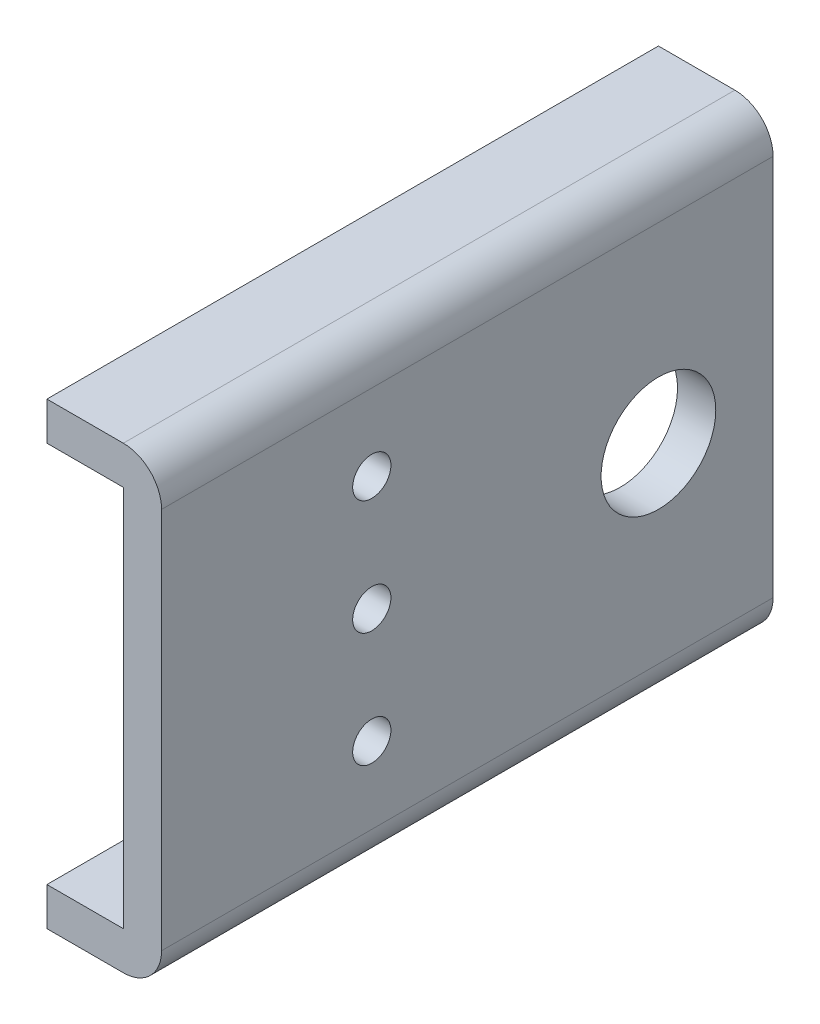
ISO-10303-21;
HEADER;
FILE_DESCRIPTION(('STEP AP214'),'2;1');
FILE_NAME('part.step','',(''),(''),'','','');
FILE_SCHEMA(('AUTOMOTIVE_DESIGN { 1 0 10303 214 1 1 1 1 }'));
ENDSEC;
DATA;
#1=APPLICATION_CONTEXT('core data for automotive mechanical design processes');
#2=APPLICATION_PROTOCOL_DEFINITION('international standard','automotive_design',2000,#1);
#3=PRODUCT_CONTEXT('',#1,'mechanical');
#4=PRODUCT('Part','Part','',(#3));
#5=PRODUCT_RELATED_PRODUCT_CATEGORY('part','',(#4));
#6=PRODUCT_DEFINITION_FORMATION('','',#4);
#7=PRODUCT_DEFINITION_CONTEXT('part definition',#1,'design');
#8=PRODUCT_DEFINITION('design','',#6,#7);
#9=PRODUCT_DEFINITION_SHAPE('','',#8);
#10=(LENGTH_UNIT() NAMED_UNIT(*) SI_UNIT(.MILLI.,.METRE.));
#11=(NAMED_UNIT(*) PLANE_ANGLE_UNIT() SI_UNIT($,.RADIAN.));
#12=(NAMED_UNIT(*) SI_UNIT($,.STERADIAN.) SOLID_ANGLE_UNIT());
#13=UNCERTAINTY_MEASURE_WITH_UNIT(LENGTH_MEASURE(1.E-05),#10,'distance_accuracy_value','');
#14=(GEOMETRIC_REPRESENTATION_CONTEXT(3) GLOBAL_UNCERTAINTY_ASSIGNED_CONTEXT((#13)) GLOBAL_UNIT_ASSIGNED_CONTEXT((#10,
#11,#12)) REPRESENTATION_CONTEXT('',''));
#15=CARTESIAN_POINT('',(0.,0.,0.));
#16=DIRECTION('',(0.,0.,1.));
#17=DIRECTION('',(1.,0.,0.));
#18=AXIS2_PLACEMENT_3D('',#15,#16,#17);
#19=CARTESIAN_POINT('',(0.,-19.05,0.));
#20=DIRECTION('',(0.,1.,0.));
#21=DIRECTION('',(-1.,0.,0.));
#22=AXIS2_PLACEMENT_3D('',#19,#20,#21);
#23=PLANE('',#22);
#24=DIRECTION('',(0.,0.,1.));
#25=VECTOR('',#24,1.);
#26=CARTESIAN_POINT('',(-9.525,-19.05,0.));
#27=LINE('',#26,#25);
#28=CARTESIAN_POINT('',(-9.525,-19.05,50.8));
#29=VERTEX_POINT('',#28);
#30=CARTESIAN_POINT('',(-9.52500000000001,-19.05,0.));
#31=VERTEX_POINT('',#30);
#32=EDGE_CURVE('E102',#29,#31,#27,.F.);
#33=ORIENTED_EDGE('',*,*,#32,.T.);
#34=DIRECTION('',(1.,0.,0.));
#35=VECTOR('',#34,1.);
#36=CARTESIAN_POINT('',(-3.17499999999999,-19.05,0.));
#37=LINE('',#36,#35);
#38=CARTESIAN_POINT('',(-3.17499999999999,-19.05,0.));
#39=VERTEX_POINT('',#38);
#40=EDGE_CURVE('E100',#31,#39,#37,.T.);
#41=ORIENTED_EDGE('',*,*,#40,.T.);
#42=DIRECTION('',(0.,0.,-1.));
#43=VECTOR('',#42,1.);
#44=CARTESIAN_POINT('',(-3.17499999999999,-19.05,0.));
#45=LINE('',#44,#43);
#46=CARTESIAN_POINT('',(-3.17499999999999,-19.05,50.8));
#47=VERTEX_POINT('',#46);
#48=EDGE_CURVE('E89',#47,#39,#45,.T.);
#49=ORIENTED_EDGE('',*,*,#48,.F.);
#50=DIRECTION('',(-1.,0.,0.));
#51=VECTOR('',#50,1.);
#52=CARTESIAN_POINT('',(-9.525,-19.05,50.8));
#53=LINE('',#52,#51);
#54=EDGE_CURVE('E96',#47,#29,#53,.T.);
#55=ORIENTED_EDGE('',*,*,#54,.T.);
#56=EDGE_LOOP('',(#33,#41,#49,#55));
#57=FACE_BOUND('',#56,.T.);
#58=ADVANCED_FACE('F16',(#57),#23,.F.);
#59=CARTESIAN_POINT('',(0.,19.05,0.));
#60=DIRECTION('',(0.,-1.,0.));
#61=DIRECTION('',(1.,0.,0.));
#62=AXIS2_PLACEMENT_3D('',#59,#60,#61);
#63=PLANE('',#62);
#64=DIRECTION('',(0.,0.,1.));
#65=VECTOR('',#64,1.);
#66=CARTESIAN_POINT('',(-9.525,19.05,50.8));
#67=LINE('',#66,#65);
#68=CARTESIAN_POINT('',(-9.525,19.05,0.));
#69=VERTEX_POINT('',#68);
#70=CARTESIAN_POINT('',(-9.52500000000001,19.05,50.8));
#71=VERTEX_POINT('',#70);
#72=EDGE_CURVE('E145',#69,#71,#67,.T.);
#73=ORIENTED_EDGE('',*,*,#72,.T.);
#74=DIRECTION('',(1.,0.,0.));
#75=VECTOR('',#74,1.);
#76=CARTESIAN_POINT('',(-3.17499999999999,19.05,50.8));
#77=LINE('',#76,#75);
#78=CARTESIAN_POINT('',(-3.17499999999999,19.05,50.8));
#79=VERTEX_POINT('',#78);
#80=EDGE_CURVE('E139',#71,#79,#77,.T.);
#81=ORIENTED_EDGE('',*,*,#80,.T.);
#82=DIRECTION('',(0.,0.,1.));
#83=VECTOR('',#82,1.);
#84=CARTESIAN_POINT('',(-3.17499999999999,19.05,50.8));
#85=LINE('',#84,#83);
#86=CARTESIAN_POINT('',(-3.17499999999999,19.05,0.));
#87=VERTEX_POINT('',#86);
#88=EDGE_CURVE('E97',#87,#79,#85,.T.);
#89=ORIENTED_EDGE('',*,*,#88,.F.);
#90=DIRECTION('',(1.,0.,0.));
#91=VECTOR('',#90,1.);
#92=CARTESIAN_POINT('',(-9.525,19.05,0.));
#93=LINE('',#92,#91);
#94=EDGE_CURVE('E115',#87,#69,#93,.F.);
#95=ORIENTED_EDGE('',*,*,#94,.T.);
#96=EDGE_LOOP('',(#73,#81,#89,#95));
#97=FACE_BOUND('',#96,.T.);
#98=ADVANCED_FACE('F255',(#97),#63,.F.);
#99=CARTESIAN_POINT('',(-3.175,15.875,50.8));
#100=DIRECTION('',(0.,0.,1.));
#101=DIRECTION('',(0.,-1.,0.));
#102=AXIS2_PLACEMENT_3D('',#99,#100,#101);
#103=CYLINDRICAL_SURFACE('',#102,3.175);
#104=CARTESIAN_POINT('',(-3.175,15.875,0.));
#105=DIRECTION('',(0.,0.,1.));
#106=DIRECTION('',(0.,-1.,0.));
#107=AXIS2_PLACEMENT_3D('',#104,#105,#106);
#108=CIRCLE('',#107,3.175);
#109=CARTESIAN_POINT('',(0.,15.875,0.));
#110=VERTEX_POINT('',#109);
#111=EDGE_CURVE('E113',#87,#110,#108,.F.);
#112=ORIENTED_EDGE('',*,*,#111,.F.);
#113=ORIENTED_EDGE('',*,*,#88,.T.);
#114=CARTESIAN_POINT('',(-3.175,15.875,50.8));
#115=DIRECTION('',(0.,0.,1.));
#116=DIRECTION('',(0.,-1.,0.));
#117=AXIS2_PLACEMENT_3D('',#114,#115,#116);
#118=CIRCLE('',#117,3.175);
#119=CARTESIAN_POINT('',(0.,15.875,50.8));
#120=VERTEX_POINT('',#119);
#121=EDGE_CURVE('E190',#79,#120,#118,.F.);
#122=ORIENTED_EDGE('',*,*,#121,.T.);
#123=DIRECTION('',(0.,0.,-1.));
#124=VECTOR('',#123,1.);
#125=CARTESIAN_POINT('',(0.,15.875,0.));
#126=LINE('',#125,#124);
#127=EDGE_CURVE('E192',#110,#120,#126,.F.);
#128=ORIENTED_EDGE('',*,*,#127,.F.);
#129=EDGE_LOOP('',(#112,#113,#122,#128));
#130=FACE_BOUND('',#129,.T.);
#131=ADVANCED_FACE('F257',(#130),#103,.T.);
#132=CARTESIAN_POINT('',(-3.175,-15.875,0.));
#133=DIRECTION('',(0.,0.,-1.));
#134=DIRECTION('',(-1.,0.,0.));
#135=AXIS2_PLACEMENT_3D('',#132,#133,#134);
#136=CYLINDRICAL_SURFACE('',#135,3.175);
#137=CARTESIAN_POINT('',(-3.175,-15.875,50.8));
#138=DIRECTION('',(0.,0.,-1.));
#139=DIRECTION('',(-1.,0.,0.));
#140=AXIS2_PLACEMENT_3D('',#137,#138,#139);
#141=CIRCLE('',#140,3.175);
#142=CARTESIAN_POINT('',(0.,-15.875,50.8));
#143=VERTEX_POINT('',#142);
#144=EDGE_CURVE('E94',#47,#143,#141,.F.);
#145=ORIENTED_EDGE('',*,*,#144,.F.);
#146=ORIENTED_EDGE('',*,*,#48,.T.);
#147=CARTESIAN_POINT('',(-3.175,-15.875,0.));
#148=DIRECTION('',(0.,0.,-1.));
#149=DIRECTION('',(-1.,0.,0.));
#150=AXIS2_PLACEMENT_3D('',#147,#148,#149);
#151=CIRCLE('',#150,3.175);
#152=CARTESIAN_POINT('',(0.,-15.875,0.));
#153=VERTEX_POINT('',#152);
#154=EDGE_CURVE('E19',#39,#153,#151,.F.);
#155=ORIENTED_EDGE('',*,*,#154,.T.);
#156=DIRECTION('',(0.,0.,-1.));
#157=VECTOR('',#156,1.);
#158=CARTESIAN_POINT('',(0.,-15.875,0.));
#159=LINE('',#158,#157);
#160=EDGE_CURVE('E196',#143,#153,#159,.T.);
#161=ORIENTED_EDGE('',*,*,#160,.F.);
#162=EDGE_LOOP('',(#145,#146,#155,#161));
#163=FACE_BOUND('',#162,.T.);
#164=ADVANCED_FACE('F91',(#163),#136,.T.);
#165=CARTESIAN_POINT('',(-9.525,-19.05,0.));
#166=DIRECTION('',(1.,0.,0.));
#167=DIRECTION('',(0.,1.,0.));
#168=AXIS2_PLACEMENT_3D('',#165,#166,#167);
#169=PLANE('',#168);
#170=DIRECTION('',(0.,1.,0.));
#171=VECTOR('',#170,1.);
#172=CARTESIAN_POINT('',(-9.525,-19.05,0.));
#173=LINE('',#172,#171);
#174=CARTESIAN_POINT('',(-9.52500000000001,-15.875,0.));
#175=VERTEX_POINT('',#174);
#176=EDGE_CURVE('E114',#31,#175,#173,.T.);
#177=ORIENTED_EDGE('',*,*,#176,.F.);
#178=ORIENTED_EDGE('',*,*,#32,.F.);
#179=DIRECTION('',(0.,1.,0.));
#180=VECTOR('',#179,1.);
#181=CARTESIAN_POINT('',(-9.525,-19.05,50.8));
#182=LINE('',#181,#180);
#183=CARTESIAN_POINT('',(-9.52500000000001,-15.875,50.8));
#184=VERTEX_POINT('',#183);
#185=EDGE_CURVE('E106',#184,#29,#182,.F.);
#186=ORIENTED_EDGE('',*,*,#185,.F.);
#187=DIRECTION('',(0.,0.,1.));
#188=VECTOR('',#187,1.);
#189=CARTESIAN_POINT('',(-9.52500000000001,-15.875,0.));
#190=LINE('',#189,#188);
#191=EDGE_CURVE('E125',#175,#184,#190,.T.);
#192=ORIENTED_EDGE('',*,*,#191,.F.);
#193=EDGE_LOOP('',(#177,#178,#186,#192));
#194=FACE_BOUND('',#193,.T.);
#195=ADVANCED_FACE('F264',(#194),#169,.F.);
#196=CARTESIAN_POINT('',(-9.525,19.05,50.8));
#197=DIRECTION('',(1.,0.,0.));
#198=DIRECTION('',(0.,1.,0.));
#199=AXIS2_PLACEMENT_3D('',#196,#197,#198);
#200=PLANE('',#199);
#201=DIRECTION('',(0.,1.,0.));
#202=VECTOR('',#201,1.);
#203=CARTESIAN_POINT('',(-9.525,19.05,50.8));
#204=LINE('',#203,#202);
#205=CARTESIAN_POINT('',(-9.52500000000001,15.875,50.8));
#206=VERTEX_POINT('',#205);
#207=EDGE_CURVE('E148',#71,#206,#204,.F.);
#208=ORIENTED_EDGE('',*,*,#207,.F.);
#209=ORIENTED_EDGE('',*,*,#72,.F.);
#210=DIRECTION('',(0.,1.,0.));
#211=VECTOR('',#210,1.);
#212=CARTESIAN_POINT('',(-9.525,19.05,0.));
#213=LINE('',#212,#211);
#214=CARTESIAN_POINT('',(-9.52500000000001,15.875,0.));
#215=VERTEX_POINT('',#214);
#216=EDGE_CURVE('E142',#215,#69,#213,.T.);
#217=ORIENTED_EDGE('',*,*,#216,.F.);
#218=DIRECTION('',(0.,0.,1.));
#219=VECTOR('',#218,1.);
#220=CARTESIAN_POINT('',(-9.52500000000001,15.875,0.));
#221=LINE('',#220,#219);
#222=EDGE_CURVE('E208',#206,#215,#221,.F.);
#223=ORIENTED_EDGE('',*,*,#222,.F.);
#224=EDGE_LOOP('',(#208,#209,#217,#223));
#225=FACE_BOUND('',#224,.T.);
#226=ADVANCED_FACE('F253',(#225),#200,.F.);
#227=CARTESIAN_POINT('',(0.,0.,0.));
#228=DIRECTION('',(1.,0.,0.));
#229=DIRECTION('',(0.,0.,-1.));
#230=AXIS2_PLACEMENT_3D('',#227,#228,#229);
#231=PLANE('',#230);
#232=DIRECTION('',(0.,1.,0.));
#233=VECTOR('',#232,1.);
#234=CARTESIAN_POINT('',(0.,15.875,0.));
#235=LINE('',#234,#233);
#236=EDGE_CURVE('E112',#110,#153,#235,.F.);
#237=ORIENTED_EDGE('',*,*,#236,.F.);
#238=ORIENTED_EDGE('',*,*,#127,.T.);
#239=DIRECTION('',(0.,1.,0.));
#240=VECTOR('',#239,1.);
#241=CARTESIAN_POINT('',(0.,15.875,50.8));
#242=LINE('',#241,#240);
#243=EDGE_CURVE('E175',#143,#120,#242,.T.);
#244=ORIENTED_EDGE('',*,*,#243,.F.);
#245=ORIENTED_EDGE('',*,*,#160,.T.);
#246=EDGE_LOOP('',(#237,#238,#244,#245));
#247=FACE_BOUND('',#246,.T.);
#248=CARTESIAN_POINT('',(0.,9.525,33.3375));
#249=DIRECTION('',(1.,0.,0.));
#250=DIRECTION('',(0.,0.,-1.));
#251=AXIS2_PLACEMENT_3D('',#248,#249,#250);
#252=CIRCLE('',#251,1.5875);
#253=CARTESIAN_POINT('',(0.,9.525,31.75));
#254=VERTEX_POINT('',#253);
#255=EDGE_CURVE('E176',#254,#254,#252,.F.);
#256=ORIENTED_EDGE('',*,*,#255,.T.);
#257=EDGE_LOOP('',(#256));
#258=FACE_BOUND('',#257,.T.);
#259=CARTESIAN_POINT('',(0.,-9.525,33.3375));
#260=DIRECTION('',(1.,0.,0.));
#261=DIRECTION('',(0.,0.,-1.));
#262=AXIS2_PLACEMENT_3D('',#259,#260,#261);
#263=CIRCLE('',#262,1.5875);
#264=CARTESIAN_POINT('',(0.,-9.525,31.75));
#265=VERTEX_POINT('',#264);
#266=EDGE_CURVE('E180',#265,#265,#263,.F.);
#267=ORIENTED_EDGE('',*,*,#266,.T.);
#268=EDGE_LOOP('',(#267));
#269=FACE_BOUND('',#268,.T.);
#270=CARTESIAN_POINT('',(0.,0.,9.525));
#271=DIRECTION('',(1.,0.,0.));
#272=DIRECTION('',(0.,0.,-1.));
#273=AXIS2_PLACEMENT_3D('',#270,#271,#272);
#274=CIRCLE('',#273,4.7625);
#275=CARTESIAN_POINT('',(0.,0.,4.7625));
#276=VERTEX_POINT('',#275);
#277=EDGE_CURVE('E183',#276,#276,#274,.F.);
#278=ORIENTED_EDGE('',*,*,#277,.T.);
#279=EDGE_LOOP('',(#278));
#280=FACE_BOUND('',#279,.T.);
#281=CARTESIAN_POINT('',(0.,0.,33.3375));
#282=DIRECTION('',(1.,0.,0.));
#283=DIRECTION('',(0.,0.,-1.));
#284=AXIS2_PLACEMENT_3D('',#281,#282,#283);
#285=CIRCLE('',#284,1.5875);
#286=CARTESIAN_POINT('',(0.,0.,31.75));
#287=VERTEX_POINT('',#286);
#288=EDGE_CURVE('E186',#287,#287,#285,.F.);
#289=ORIENTED_EDGE('',*,*,#288,.T.);
#290=EDGE_LOOP('',(#289));
#291=FACE_BOUND('',#290,.T.);
#292=ADVANCED_FACE('F258',(#247,#258,#269,#280,#291),#231,.T.);
#293=CARTESIAN_POINT('',(-9.52500000000001,0.,33.3375));
#294=DIRECTION('',(1.,0.,0.));
#295=DIRECTION('',(0.,0.,-1.));
#296=AXIS2_PLACEMENT_3D('',#293,#294,#295);
#297=CYLINDRICAL_SURFACE('',#296,1.5875);
#298=CARTESIAN_POINT('',(-3.175,0.,33.3375));
#299=DIRECTION('',(1.,0.,0.));
#300=DIRECTION('',(0.,0.,-1.));
#301=AXIS2_PLACEMENT_3D('',#298,#299,#300);
#302=CIRCLE('',#301,1.5875);
#303=CARTESIAN_POINT('',(-3.175,0.,31.75));
#304=VERTEX_POINT('',#303);
#305=EDGE_CURVE('E172',#304,#304,#302,.F.);
#306=ORIENTED_EDGE('',*,*,#305,.T.);
#307=EDGE_LOOP('',(#306));
#308=FACE_BOUND('',#307,.T.);
#309=ORIENTED_EDGE('',*,*,#288,.F.);
#310=EDGE_LOOP('',(#309));
#311=FACE_BOUND('',#310,.T.);
#312=ADVANCED_FACE('F298',(#308,#311),#297,.F.);
#313=CARTESIAN_POINT('',(-9.52500000000001,0.,9.525));
#314=DIRECTION('',(1.,0.,0.));
#315=DIRECTION('',(0.,0.,-1.));
#316=AXIS2_PLACEMENT_3D('',#313,#314,#315);
#317=CYLINDRICAL_SURFACE('',#316,4.7625);
#318=CARTESIAN_POINT('',(-3.175,0.,9.525));
#319=DIRECTION('',(1.,0.,0.));
#320=DIRECTION('',(0.,0.,-1.));
#321=AXIS2_PLACEMENT_3D('',#318,#319,#320);
#322=CIRCLE('',#321,4.7625);
#323=CARTESIAN_POINT('',(-3.175,0.,4.7625));
#324=VERTEX_POINT('',#323);
#325=EDGE_CURVE('E169',#324,#324,#322,.F.);
#326=ORIENTED_EDGE('',*,*,#325,.T.);
#327=EDGE_LOOP('',(#326));
#328=FACE_BOUND('',#327,.T.);
#329=ORIENTED_EDGE('',*,*,#277,.F.);
#330=EDGE_LOOP('',(#329));
#331=FACE_BOUND('',#330,.T.);
#332=ADVANCED_FACE('F294',(#328,#331),#317,.F.);
#333=CARTESIAN_POINT('',(-9.52500000000001,-9.525,33.3375));
#334=DIRECTION('',(1.,0.,0.));
#335=DIRECTION('',(0.,0.,-1.));
#336=AXIS2_PLACEMENT_3D('',#333,#334,#335);
#337=CYLINDRICAL_SURFACE('',#336,1.5875);
#338=CARTESIAN_POINT('',(-3.175,-9.525,33.3375));
#339=DIRECTION('',(1.,0.,0.));
#340=DIRECTION('',(0.,0.,-1.));
#341=AXIS2_PLACEMENT_3D('',#338,#339,#340);
#342=CIRCLE('',#341,1.5875);
#343=CARTESIAN_POINT('',(-3.175,-9.525,31.75));
#344=VERTEX_POINT('',#343);
#345=EDGE_CURVE('E166',#344,#344,#342,.F.);
#346=ORIENTED_EDGE('',*,*,#345,.T.);
#347=EDGE_LOOP('',(#346));
#348=FACE_BOUND('',#347,.T.);
#349=ORIENTED_EDGE('',*,*,#266,.F.);
#350=EDGE_LOOP('',(#349));
#351=FACE_BOUND('',#350,.T.);
#352=ADVANCED_FACE('F290',(#348,#351),#337,.F.);
#353=CARTESIAN_POINT('',(-9.52500000000001,9.525,33.3375));
#354=DIRECTION('',(1.,0.,0.));
#355=DIRECTION('',(0.,0.,-1.));
#356=AXIS2_PLACEMENT_3D('',#353,#354,#355);
#357=CYLINDRICAL_SURFACE('',#356,1.5875);
#358=CARTESIAN_POINT('',(-3.175,9.525,33.3375));
#359=DIRECTION('',(1.,0.,0.));
#360=DIRECTION('',(0.,0.,-1.));
#361=AXIS2_PLACEMENT_3D('',#358,#359,#360);
#362=CIRCLE('',#361,1.5875);
#363=CARTESIAN_POINT('',(-3.175,9.525,31.75));
#364=VERTEX_POINT('',#363);
#365=EDGE_CURVE('E162',#364,#364,#362,.F.);
#366=ORIENTED_EDGE('',*,*,#365,.T.);
#367=EDGE_LOOP('',(#366));
#368=FACE_BOUND('',#367,.T.);
#369=ORIENTED_EDGE('',*,*,#255,.F.);
#370=EDGE_LOOP('',(#369));
#371=FACE_BOUND('',#370,.T.);
#372=ADVANCED_FACE('F287',(#368,#371),#357,.F.);
#373=CARTESIAN_POINT('',(0.,-15.875,0.));
#374=DIRECTION('',(0.,1.,0.));
#375=DIRECTION('',(-1.,0.,0.));
#376=AXIS2_PLACEMENT_3D('',#373,#374,#375);
#377=PLANE('',#376);
#378=DIRECTION('',(-1.,0.,0.));
#379=VECTOR('',#378,1.);
#380=CARTESIAN_POINT('',(0.,-15.875,0.));
#381=LINE('',#380,#379);
#382=CARTESIAN_POINT('',(-3.175,-15.875,0.));
#383=VERTEX_POINT('',#382);
#384=EDGE_CURVE('E128',#383,#175,#381,.T.);
#385=ORIENTED_EDGE('',*,*,#384,.T.);
#386=ORIENTED_EDGE('',*,*,#191,.T.);
#387=DIRECTION('',(-1.,0.,0.));
#388=VECTOR('',#387,1.);
#389=CARTESIAN_POINT('',(0.,-15.875,50.8));
#390=LINE('',#389,#388);
#391=CARTESIAN_POINT('',(-3.175,-15.875,50.8));
#392=VERTEX_POINT('',#391);
#393=EDGE_CURVE('E179',#184,#392,#390,.F.);
#394=ORIENTED_EDGE('',*,*,#393,.T.);
#395=DIRECTION('',(0.,0.,-1.));
#396=VECTOR('',#395,1.);
#397=CARTESIAN_POINT('',(-3.175,-15.875,0.));
#398=LINE('',#397,#396);
#399=EDGE_CURVE('E165',#392,#383,#398,.T.);
#400=ORIENTED_EDGE('',*,*,#399,.T.);
#401=EDGE_LOOP('',(#385,#386,#394,#400));
#402=FACE_BOUND('',#401,.T.);
#403=ADVANCED_FACE('F261',(#402),#377,.T.);
#404=CARTESIAN_POINT('',(-3.175,15.875,0.));
#405=DIRECTION('',(0.,0.,-1.));
#406=DIRECTION('',(-1.,0.,0.));
#407=AXIS2_PLACEMENT_3D('',#404,#405,#406);
#408=PLANE('',#407);
#409=DIRECTION('',(0.,1.,0.));
#410=VECTOR('',#409,1.);
#411=CARTESIAN_POINT('',(-3.175,0.,0.));
#412=LINE('',#411,#410);
#413=CARTESIAN_POINT('',(-3.175,15.875,0.));
#414=VERTEX_POINT('',#413);
#415=EDGE_CURVE('E218',#383,#414,#412,.T.);
#416=ORIENTED_EDGE('',*,*,#415,.T.);
#417=DIRECTION('',(1.,0.,0.));
#418=VECTOR('',#417,1.);
#419=CARTESIAN_POINT('',(0.,15.875,0.));
#420=LINE('',#419,#418);
#421=EDGE_CURVE('E214',#215,#414,#420,.T.);
#422=ORIENTED_EDGE('',*,*,#421,.F.);
#423=ORIENTED_EDGE('',*,*,#216,.T.);
#424=ORIENTED_EDGE('',*,*,#94,.F.);
#425=ORIENTED_EDGE('',*,*,#111,.T.);
#426=ORIENTED_EDGE('',*,*,#236,.T.);
#427=ORIENTED_EDGE('',*,*,#154,.F.);
#428=ORIENTED_EDGE('',*,*,#40,.F.);
#429=ORIENTED_EDGE('',*,*,#176,.T.);
#430=ORIENTED_EDGE('',*,*,#384,.F.);
#431=EDGE_LOOP('',(#416,#422,#423,#424,#425,#426,#427,#428,#429,#430));
#432=FACE_BOUND('',#431,.T.);
#433=ADVANCED_FACE('F110',(#432),#408,.T.);
#434=CARTESIAN_POINT('',(0.,15.875,0.));
#435=DIRECTION('',(0.,-1.,0.));
#436=DIRECTION('',(1.,0.,0.));
#437=AXIS2_PLACEMENT_3D('',#434,#435,#436);
#438=PLANE('',#437);
#439=DIRECTION('',(1.,0.,0.));
#440=VECTOR('',#439,1.);
#441=CARTESIAN_POINT('',(0.,15.875,50.8));
#442=LINE('',#441,#440);
#443=CARTESIAN_POINT('',(-3.175,15.875,50.8));
#444=VERTEX_POINT('',#443);
#445=EDGE_CURVE('E33',#444,#206,#442,.F.);
#446=ORIENTED_EDGE('',*,*,#445,.T.);
#447=ORIENTED_EDGE('',*,*,#222,.T.);
#448=ORIENTED_EDGE('',*,*,#421,.T.);
#449=DIRECTION('',(0.,0.,-1.));
#450=VECTOR('',#449,1.);
#451=CARTESIAN_POINT('',(-3.175,15.875,0.));
#452=LINE('',#451,#450);
#453=EDGE_CURVE('E25',#414,#444,#452,.F.);
#454=ORIENTED_EDGE('',*,*,#453,.T.);
#455=EDGE_LOOP('',(#446,#447,#448,#454));
#456=FACE_BOUND('',#455,.T.);
#457=ADVANCED_FACE('F242',(#456),#438,.T.);
#458=CARTESIAN_POINT('',(-3.175,15.875,50.8));
#459=DIRECTION('',(0.,0.,1.));
#460=DIRECTION('',(1.,0.,0.));
#461=AXIS2_PLACEMENT_3D('',#458,#459,#460);
#462=PLANE('',#461);
#463=DIRECTION('',(0.,1.,0.));
#464=VECTOR('',#463,1.);
#465=CARTESIAN_POINT('',(-3.175,0.,50.8));
#466=LINE('',#465,#464);
#467=EDGE_CURVE('E11',#444,#392,#466,.F.);
#468=ORIENTED_EDGE('',*,*,#467,.T.);
#469=ORIENTED_EDGE('',*,*,#393,.F.);
#470=ORIENTED_EDGE('',*,*,#185,.T.);
#471=ORIENTED_EDGE('',*,*,#54,.F.);
#472=ORIENTED_EDGE('',*,*,#144,.T.);
#473=ORIENTED_EDGE('',*,*,#243,.T.);
#474=ORIENTED_EDGE('',*,*,#121,.F.);
#475=ORIENTED_EDGE('',*,*,#80,.F.);
#476=ORIENTED_EDGE('',*,*,#207,.T.);
#477=ORIENTED_EDGE('',*,*,#445,.F.);
#478=EDGE_LOOP('',(#468,#469,#470,#471,#472,#473,#474,#475,#476,#477));
#479=FACE_BOUND('',#478,.T.);
#480=ADVANCED_FACE('F262',(#479),#462,.T.);
#481=CARTESIAN_POINT('',(-3.175,0.,0.));
#482=DIRECTION('',(1.,0.,0.));
#483=DIRECTION('',(0.,0.,-1.));
#484=AXIS2_PLACEMENT_3D('',#481,#482,#483);
#485=PLANE('',#484);
#486=ORIENTED_EDGE('',*,*,#453,.F.);
#487=ORIENTED_EDGE('',*,*,#415,.F.);
#488=ORIENTED_EDGE('',*,*,#399,.F.);
#489=ORIENTED_EDGE('',*,*,#467,.F.);
#490=EDGE_LOOP('',(#486,#487,#488,#489));
#491=FACE_BOUND('',#490,.T.);
#492=ORIENTED_EDGE('',*,*,#365,.F.);
#493=EDGE_LOOP('',(#492));
#494=FACE_BOUND('',#493,.T.);
#495=ORIENTED_EDGE('',*,*,#345,.F.);
#496=EDGE_LOOP('',(#495));
#497=FACE_BOUND('',#496,.T.);
#498=ORIENTED_EDGE('',*,*,#325,.F.);
#499=EDGE_LOOP('',(#498));
#500=FACE_BOUND('',#499,.T.);
#501=ORIENTED_EDGE('',*,*,#305,.F.);
#502=EDGE_LOOP('',(#501));
#503=FACE_BOUND('',#502,.T.);
#504=ADVANCED_FACE('F246',(#491,#494,#497,#500,#503),#485,.F.);
#505=CLOSED_SHELL('',(#58,#98,#131,#164,#195,#226,#292,#312,#332,#352,#372,#403,#433,#457,#480,#504));
#506=MANIFOLD_SOLID_BREP('B1',#505);
#507=ADVANCED_BREP_SHAPE_REPRESENTATION('',(#18,#506),#14);
#508=SHAPE_DEFINITION_REPRESENTATION(#9,#507);
ENDSEC;
END-ISO-10303-21;
